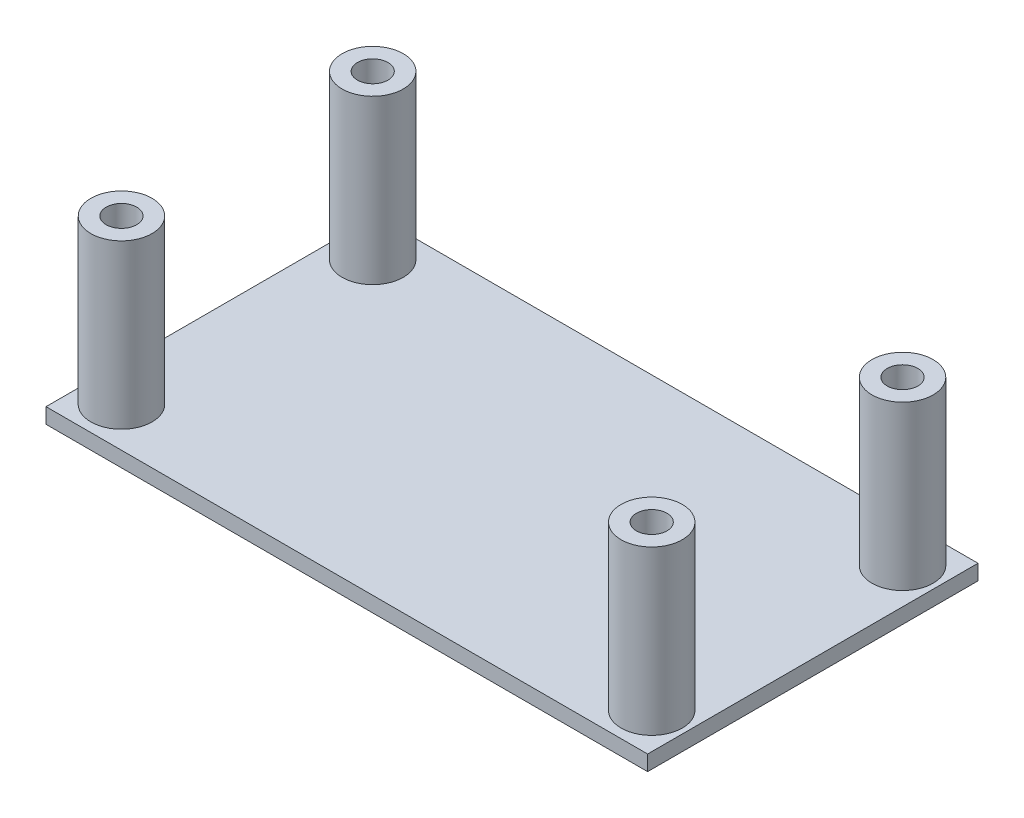
ISO-10303-21;
HEADER;
FILE_DESCRIPTION(('STEP AP214'),'2;1');
FILE_NAME('part.step','',(''),(''),'','','');
FILE_SCHEMA(('AUTOMOTIVE_DESIGN { 1 0 10303 214 1 1 1 1 }'));
ENDSEC;
DATA;
#1=APPLICATION_CONTEXT('core data for automotive mechanical design processes');
#2=APPLICATION_PROTOCOL_DEFINITION('international standard','automotive_design',2000,#1);
#3=PRODUCT_CONTEXT('',#1,'mechanical');
#4=PRODUCT('Part','Part','',(#3));
#5=PRODUCT_RELATED_PRODUCT_CATEGORY('part','',(#4));
#6=PRODUCT_DEFINITION_FORMATION('','',#4);
#7=PRODUCT_DEFINITION_CONTEXT('part definition',#1,'design');
#8=PRODUCT_DEFINITION('design','',#6,#7);
#9=PRODUCT_DEFINITION_SHAPE('','',#8);
#10=(LENGTH_UNIT() NAMED_UNIT(*) SI_UNIT(.MILLI.,.METRE.));
#11=(NAMED_UNIT(*) PLANE_ANGLE_UNIT() SI_UNIT($,.RADIAN.));
#12=(NAMED_UNIT(*) SI_UNIT($,.STERADIAN.) SOLID_ANGLE_UNIT());
#13=UNCERTAINTY_MEASURE_WITH_UNIT(LENGTH_MEASURE(1.E-05),#10,'distance_accuracy_value','');
#14=(GEOMETRIC_REPRESENTATION_CONTEXT(3) GLOBAL_UNCERTAINTY_ASSIGNED_CONTEXT((#13)) GLOBAL_UNIT_ASSIGNED_CONTEXT((#10,
#11,#12)) REPRESENTATION_CONTEXT('',''));
#15=CARTESIAN_POINT('',(0.,0.,0.));
#16=DIRECTION('',(0.,0.,1.));
#17=DIRECTION('',(1.,0.,0.));
#18=AXIS2_PLACEMENT_3D('',#15,#16,#17);
#19=CARTESIAN_POINT('',(0.,1.5,0.));
#20=DIRECTION('',(0.,1.,0.));
#21=DIRECTION('',(0.,0.,1.));
#22=AXIS2_PLACEMENT_3D('',#19,#20,#21);
#23=PLANE('',#22);
#24=DIRECTION('',(0.,0.,-1.));
#25=VECTOR('',#24,1.);
#26=CARTESIAN_POINT('',(33.3618988565565,1.5,-11.6656738072446));
#27=LINE('',#26,#25);
#28=CARTESIAN_POINT('',(33.3618988565565,1.5,20.7343261927554));
#29=VERTEX_POINT('',#28);
#30=CARTESIAN_POINT('',(33.3618988565565,1.5,-11.6656738072446));
#31=VERTEX_POINT('',#30);
#32=EDGE_CURVE('E79',#29,#31,#27,.T.);
#33=ORIENTED_EDGE('',*,*,#32,.T.);
#34=DIRECTION('',(1.,0.,0.));
#35=VECTOR('',#34,1.);
#36=CARTESIAN_POINT('',(-24.6381011434435,1.5,-11.6656738072446));
#37=LINE('',#36,#35);
#38=CARTESIAN_POINT('',(-25.6381011434435,1.5,-11.6656738072446));
#39=VERTEX_POINT('',#38);
#40=EDGE_CURVE('E109',#39,#31,#37,.T.);
#41=ORIENTED_EDGE('',*,*,#40,.F.);
#42=DIRECTION('',(0.,0.,1.));
#43=VECTOR('',#42,1.);
#44=CARTESIAN_POINT('',(-25.6381011434435,1.5,-11.6656738072446));
#45=LINE('',#44,#43);
#46=CARTESIAN_POINT('',(-25.6381011434435,1.5,20.7343261927554));
#47=VERTEX_POINT('',#46);
#48=EDGE_CURVE('E81',#39,#47,#45,.T.);
#49=ORIENTED_EDGE('',*,*,#48,.T.);
#50=DIRECTION('',(-1.,0.,0.));
#51=VECTOR('',#50,1.);
#52=CARTESIAN_POINT('',(-24.6381011434435,1.5,20.7343261927554));
#53=LINE('',#52,#51);
#54=EDGE_CURVE('E75',#29,#47,#53,.T.);
#55=ORIENTED_EDGE('',*,*,#54,.F.);
#56=EDGE_LOOP('',(#33,#41,#49,#55));
#57=FACE_BOUND('',#56,.T.);
#58=CARTESIAN_POINT('',(29.8618988565565,1.5,-7.76567380724461));
#59=DIRECTION('',(0.,1.,0.));
#60=DIRECTION('',(0.,0.,1.));
#61=AXIS2_PLACEMENT_3D('',#58,#59,#60);
#62=CIRCLE('',#61,3.);
#63=CARTESIAN_POINT('',(29.8618988565565,1.5,-4.76567380724461));
#64=VERTEX_POINT('',#63);
#65=EDGE_CURVE('E150',#64,#64,#62,.F.);
#66=ORIENTED_EDGE('',*,*,#65,.T.);
#67=EDGE_LOOP('',(#66));
#68=FACE_BOUND('',#67,.T.);
#69=CARTESIAN_POINT('',(29.8618988565565,1.5,16.8343261927554));
#70=DIRECTION('',(0.,1.,0.));
#71=DIRECTION('',(0.,0.,1.));
#72=AXIS2_PLACEMENT_3D('',#69,#70,#71);
#73=CIRCLE('',#72,3.);
#74=CARTESIAN_POINT('',(29.8618988565565,1.5,19.8343261927554));
#75=VERTEX_POINT('',#74);
#76=EDGE_CURVE('E11',#75,#75,#73,.F.);
#77=ORIENTED_EDGE('',*,*,#76,.T.);
#78=EDGE_LOOP('',(#77));
#79=FACE_BOUND('',#78,.T.);
#80=CARTESIAN_POINT('',(-22.1381011434435,1.5,16.8343261927554));
#81=DIRECTION('',(0.,1.,0.));
#82=DIRECTION('',(0.,0.,1.));
#83=AXIS2_PLACEMENT_3D('',#80,#81,#82);
#84=CIRCLE('',#83,3.);
#85=CARTESIAN_POINT('',(-22.1381011434435,1.5,19.8343261927554));
#86=VERTEX_POINT('',#85);
#87=EDGE_CURVE('E144',#86,#86,#84,.F.);
#88=ORIENTED_EDGE('',*,*,#87,.T.);
#89=EDGE_LOOP('',(#88));
#90=FACE_BOUND('',#89,.T.);
#91=CARTESIAN_POINT('',(-22.0993702767908,1.5,-7.76567380724461));
#92=DIRECTION('',(0.,1.,0.));
#93=DIRECTION('',(0.,0.,1.));
#94=AXIS2_PLACEMENT_3D('',#91,#92,#93);
#95=CIRCLE('',#94,3.);
#96=CARTESIAN_POINT('',(-22.0993702767908,1.5,-4.76567380724461));
#97=VERTEX_POINT('',#96);
#98=EDGE_CURVE('E138',#97,#97,#95,.T.);
#99=ORIENTED_EDGE('',*,*,#98,.F.);
#100=EDGE_LOOP('',(#99));
#101=FACE_BOUND('',#100,.T.);
#102=ADVANCED_FACE('F33',(#57,#68,#79,#90,#101),#23,.T.);
#103=CARTESIAN_POINT('',(0.,0.,0.));
#104=DIRECTION('',(0.,1.,0.));
#105=DIRECTION('',(0.,0.,1.));
#106=AXIS2_PLACEMENT_3D('',#103,#104,#105);
#107=PLANE('',#106);
#108=DIRECTION('',(-1.,0.,0.));
#109=VECTOR('',#108,1.);
#110=CARTESIAN_POINT('',(-24.6381011434435,0.,20.7343261927554));
#111=LINE('',#110,#109);
#112=CARTESIAN_POINT('',(33.3618988565565,0.,20.7343261927554));
#113=VERTEX_POINT('',#112);
#114=CARTESIAN_POINT('',(-25.6381011434435,0.,20.7343261927554));
#115=VERTEX_POINT('',#114);
#116=EDGE_CURVE('E55',#113,#115,#111,.T.);
#117=ORIENTED_EDGE('',*,*,#116,.T.);
#118=DIRECTION('',(0.,0.,-1.));
#119=VECTOR('',#118,1.);
#120=CARTESIAN_POINT('',(-25.6381011434435,0.,-11.6656738072446));
#121=LINE('',#120,#119);
#122=CARTESIAN_POINT('',(-25.6381011434435,0.,-11.6656738072446));
#123=VERTEX_POINT('',#122);
#124=EDGE_CURVE('E85',#115,#123,#121,.T.);
#125=ORIENTED_EDGE('',*,*,#124,.T.);
#126=DIRECTION('',(1.,0.,0.));
#127=VECTOR('',#126,1.);
#128=CARTESIAN_POINT('',(-24.6381011434435,0.,-11.6656738072446));
#129=LINE('',#128,#127);
#130=CARTESIAN_POINT('',(33.3618988565565,0.,-11.6656738072446));
#131=VERTEX_POINT('',#130);
#132=EDGE_CURVE('E48',#123,#131,#129,.T.);
#133=ORIENTED_EDGE('',*,*,#132,.T.);
#134=DIRECTION('',(0.,0.,1.));
#135=VECTOR('',#134,1.);
#136=CARTESIAN_POINT('',(33.3618988565565,0.,-11.6656738072446));
#137=LINE('',#136,#135);
#138=EDGE_CURVE('E99',#131,#113,#137,.T.);
#139=ORIENTED_EDGE('',*,*,#138,.T.);
#140=EDGE_LOOP('',(#117,#125,#133,#139));
#141=FACE_BOUND('',#140,.T.);
#142=ADVANCED_FACE('F35',(#141),#107,.F.);
#143=CARTESIAN_POINT('',(-22.0993702767908,17.5,-7.76567380724461));
#144=DIRECTION('',(0.,1.,0.));
#145=DIRECTION('',(0.,0.,1.));
#146=AXIS2_PLACEMENT_3D('',#143,#144,#145);
#147=PLANE('',#146);
#148=CARTESIAN_POINT('',(-22.0993702767908,17.5,-7.76567380724461));
#149=DIRECTION('',(0.,1.,0.));
#150=DIRECTION('',(0.,0.,1.));
#151=AXIS2_PLACEMENT_3D('',#148,#149,#150);
#152=CIRCLE('',#151,3.);
#153=CARTESIAN_POINT('',(-22.0993702767908,17.5,-4.76567380724461));
#154=VERTEX_POINT('',#153);
#155=EDGE_CURVE('E133',#154,#154,#152,.T.);
#156=ORIENTED_EDGE('',*,*,#155,.T.);
#157=EDGE_LOOP('',(#156));
#158=FACE_BOUND('',#157,.T.);
#159=CARTESIAN_POINT('',(-22.0993702767908,17.5,-7.76567380724461));
#160=DIRECTION('',(0.,1.,0.));
#161=DIRECTION('',(0.,0.,1.));
#162=AXIS2_PLACEMENT_3D('',#159,#160,#161);
#163=CIRCLE('',#162,1.5);
#164=CARTESIAN_POINT('',(-22.0993702767908,17.5,-6.26567380724461));
#165=VERTEX_POINT('',#164);
#166=EDGE_CURVE('E130',#165,#165,#163,.T.);
#167=ORIENTED_EDGE('',*,*,#166,.F.);
#168=EDGE_LOOP('',(#167));
#169=FACE_BOUND('',#168,.T.);
#170=ADVANCED_FACE('F182',(#158,#169),#147,.T.);
#171=CARTESIAN_POINT('',(-22.0993702767908,17.5,-7.76567380724461));
#172=DIRECTION('',(0.,-1.,0.));
#173=DIRECTION('',(0.,0.,-1.));
#174=AXIS2_PLACEMENT_3D('',#171,#172,#173);
#175=CYLINDRICAL_SURFACE('',#174,3.);
#176=ORIENTED_EDGE('',*,*,#155,.F.);
#177=EDGE_LOOP('',(#176));
#178=FACE_BOUND('',#177,.T.);
#179=ORIENTED_EDGE('',*,*,#98,.T.);
#180=EDGE_LOOP('',(#179));
#181=FACE_BOUND('',#180,.T.);
#182=ADVANCED_FACE('F196',(#178,#181),#175,.T.);
#183=CARTESIAN_POINT('',(-22.0993702767908,17.5,-7.76567380724461));
#184=DIRECTION('',(0.,-1.,0.));
#185=DIRECTION('',(0.,0.,-1.));
#186=AXIS2_PLACEMENT_3D('',#183,#184,#185);
#187=CYLINDRICAL_SURFACE('',#186,1.5);
#188=ORIENTED_EDGE('',*,*,#166,.T.);
#189=EDGE_LOOP('',(#188));
#190=FACE_BOUND('',#189,.T.);
#191=CARTESIAN_POINT('',(-22.0993702767908,1.5,-7.76567380724461));
#192=DIRECTION('',(0.,1.,0.));
#193=DIRECTION('',(0.,0.,1.));
#194=AXIS2_PLACEMENT_3D('',#191,#192,#193);
#195=CIRCLE('',#194,1.5);
#196=CARTESIAN_POINT('',(-22.0993702767908,1.5,-6.26567380724461));
#197=VERTEX_POINT('',#196);
#198=EDGE_CURVE('E129',#197,#197,#195,.T.);
#199=ORIENTED_EDGE('',*,*,#198,.F.);
#200=EDGE_LOOP('',(#199));
#201=FACE_BOUND('',#200,.T.);
#202=ADVANCED_FACE('F185',(#190,#201),#187,.F.);
#203=ORIENTED_EDGE('',*,*,#198,.T.);
#204=EDGE_LOOP('',(#203));
#205=FACE_BOUND('',#204,.T.);
#206=ADVANCED_FACE('F178',(#205),#23,.T.);
#207=CARTESIAN_POINT('',(-22.1381011434435,17.5,16.8343261927554));
#208=DIRECTION('',(0.,1.,0.));
#209=DIRECTION('',(0.,0.,1.));
#210=AXIS2_PLACEMENT_3D('',#207,#208,#209);
#211=PLANE('',#210);
#212=CARTESIAN_POINT('',(-22.1381011434435,17.5,16.8343261927554));
#213=DIRECTION('',(0.,1.,0.));
#214=DIRECTION('',(0.,0.,1.));
#215=AXIS2_PLACEMENT_3D('',#212,#213,#214);
#216=CIRCLE('',#215,3.);
#217=CARTESIAN_POINT('',(-22.1381011434435,17.5,19.8343261927554));
#218=VERTEX_POINT('',#217);
#219=EDGE_CURVE('E126',#218,#218,#216,.T.);
#220=ORIENTED_EDGE('',*,*,#219,.T.);
#221=EDGE_LOOP('',(#220));
#222=FACE_BOUND('',#221,.T.);
#223=CARTESIAN_POINT('',(-22.1381011434435,17.5,16.8343261927554));
#224=DIRECTION('',(0.,1.,0.));
#225=DIRECTION('',(0.,0.,1.));
#226=AXIS2_PLACEMENT_3D('',#223,#224,#225);
#227=CIRCLE('',#226,1.5);
#228=CARTESIAN_POINT('',(-22.1381011434435,17.5,18.3343261927554));
#229=VERTEX_POINT('',#228);
#230=EDGE_CURVE('E123',#229,#229,#227,.T.);
#231=ORIENTED_EDGE('',*,*,#230,.F.);
#232=EDGE_LOOP('',(#231));
#233=FACE_BOUND('',#232,.T.);
#234=ADVANCED_FACE('F184',(#222,#233),#211,.T.);
#235=CARTESIAN_POINT('',(-22.1381011434435,17.5,16.8343261927554));
#236=DIRECTION('',(0.,-1.,0.));
#237=DIRECTION('',(0.,0.,-1.));
#238=AXIS2_PLACEMENT_3D('',#235,#236,#237);
#239=CYLINDRICAL_SURFACE('',#238,3.);
#240=ORIENTED_EDGE('',*,*,#219,.F.);
#241=EDGE_LOOP('',(#240));
#242=FACE_BOUND('',#241,.T.);
#243=ORIENTED_EDGE('',*,*,#87,.F.);
#244=EDGE_LOOP('',(#243));
#245=FACE_BOUND('',#244,.T.);
#246=ADVANCED_FACE('F192',(#242,#245),#239,.T.);
#247=CARTESIAN_POINT('',(-22.1381011434435,17.5,16.8343261927554));
#248=DIRECTION('',(0.,-1.,0.));
#249=DIRECTION('',(0.,0.,-1.));
#250=AXIS2_PLACEMENT_3D('',#247,#248,#249);
#251=CYLINDRICAL_SURFACE('',#250,1.5);
#252=ORIENTED_EDGE('',*,*,#230,.T.);
#253=EDGE_LOOP('',(#252));
#254=FACE_BOUND('',#253,.T.);
#255=CARTESIAN_POINT('',(-22.1381011434435,1.5,16.8343261927554));
#256=DIRECTION('',(0.,1.,0.));
#257=DIRECTION('',(0.,0.,1.));
#258=AXIS2_PLACEMENT_3D('',#255,#256,#257);
#259=CIRCLE('',#258,1.5);
#260=CARTESIAN_POINT('',(-22.1381011434435,1.5,18.3343261927554));
#261=VERTEX_POINT('',#260);
#262=EDGE_CURVE('E141',#261,#261,#259,.F.);
#263=ORIENTED_EDGE('',*,*,#262,.T.);
#264=EDGE_LOOP('',(#263));
#265=FACE_BOUND('',#264,.T.);
#266=ADVANCED_FACE('F201',(#254,#265),#251,.F.);
#267=ORIENTED_EDGE('',*,*,#262,.F.);
#268=EDGE_LOOP('',(#267));
#269=FACE_BOUND('',#268,.T.);
#270=ADVANCED_FACE('F176',(#269),#23,.T.);
#271=CARTESIAN_POINT('',(29.8618988565565,17.5,-7.76567380724461));
#272=DIRECTION('',(0.,1.,0.));
#273=DIRECTION('',(0.,0.,1.));
#274=AXIS2_PLACEMENT_3D('',#271,#272,#273);
#275=PLANE('',#274);
#276=CARTESIAN_POINT('',(29.8618988565565,17.5,-7.76567380724461));
#277=DIRECTION('',(0.,1.,0.));
#278=DIRECTION('',(0.,0.,1.));
#279=AXIS2_PLACEMENT_3D('',#276,#277,#278);
#280=CIRCLE('',#279,3.);
#281=CARTESIAN_POINT('',(29.8618988565565,17.5,-4.76567380724461));
#282=VERTEX_POINT('',#281);
#283=EDGE_CURVE('E120',#282,#282,#280,.T.);
#284=ORIENTED_EDGE('',*,*,#283,.T.);
#285=EDGE_LOOP('',(#284));
#286=FACE_BOUND('',#285,.T.);
#287=CARTESIAN_POINT('',(29.8618988565565,17.5,-7.76567380724461));
#288=DIRECTION('',(0.,1.,0.));
#289=DIRECTION('',(0.,0.,1.));
#290=AXIS2_PLACEMENT_3D('',#287,#288,#289);
#291=CIRCLE('',#290,1.5);
#292=CARTESIAN_POINT('',(29.8618988565565,17.5,-6.26567380724461));
#293=VERTEX_POINT('',#292);
#294=EDGE_CURVE('E117',#293,#293,#291,.T.);
#295=ORIENTED_EDGE('',*,*,#294,.F.);
#296=EDGE_LOOP('',(#295));
#297=FACE_BOUND('',#296,.T.);
#298=ADVANCED_FACE('F200',(#286,#297),#275,.T.);
#299=CARTESIAN_POINT('',(29.8618988565565,17.5,-7.76567380724461));
#300=DIRECTION('',(0.,-1.,0.));
#301=DIRECTION('',(0.,0.,-1.));
#302=AXIS2_PLACEMENT_3D('',#299,#300,#301);
#303=CYLINDRICAL_SURFACE('',#302,3.);
#304=ORIENTED_EDGE('',*,*,#283,.F.);
#305=EDGE_LOOP('',(#304));
#306=FACE_BOUND('',#305,.T.);
#307=ORIENTED_EDGE('',*,*,#65,.F.);
#308=EDGE_LOOP('',(#307));
#309=FACE_BOUND('',#308,.T.);
#310=ADVANCED_FACE('F208',(#306,#309),#303,.T.);
#311=CARTESIAN_POINT('',(29.8618988565565,17.5,-7.76567380724461));
#312=DIRECTION('',(0.,-1.,0.));
#313=DIRECTION('',(0.,0.,-1.));
#314=AXIS2_PLACEMENT_3D('',#311,#312,#313);
#315=CYLINDRICAL_SURFACE('',#314,1.5);
#316=ORIENTED_EDGE('',*,*,#294,.T.);
#317=EDGE_LOOP('',(#316));
#318=FACE_BOUND('',#317,.T.);
#319=CARTESIAN_POINT('',(29.8618988565565,1.5,-7.76567380724461));
#320=DIRECTION('',(0.,1.,0.));
#321=DIRECTION('',(0.,0.,1.));
#322=AXIS2_PLACEMENT_3D('',#319,#320,#321);
#323=CIRCLE('',#322,1.5);
#324=CARTESIAN_POINT('',(29.8618988565565,1.5,-6.26567380724461));
#325=VERTEX_POINT('',#324);
#326=EDGE_CURVE('E147',#325,#325,#323,.F.);
#327=ORIENTED_EDGE('',*,*,#326,.T.);
#328=EDGE_LOOP('',(#327));
#329=FACE_BOUND('',#328,.T.);
#330=ADVANCED_FACE('F174',(#318,#329),#315,.F.);
#331=ORIENTED_EDGE('',*,*,#326,.F.);
#332=EDGE_LOOP('',(#331));
#333=FACE_BOUND('',#332,.T.);
#334=ADVANCED_FACE('F159',(#333),#23,.T.);
#335=CARTESIAN_POINT('',(29.8618988565565,17.5,16.8343261927554));
#336=DIRECTION('',(0.,1.,0.));
#337=DIRECTION('',(0.,0.,1.));
#338=AXIS2_PLACEMENT_3D('',#335,#336,#337);
#339=PLANE('',#338);
#340=CARTESIAN_POINT('',(29.8618988565565,17.5,16.8343261927554));
#341=DIRECTION('',(0.,1.,0.));
#342=DIRECTION('',(0.,0.,1.));
#343=AXIS2_PLACEMENT_3D('',#340,#341,#342);
#344=CIRCLE('',#343,3.);
#345=CARTESIAN_POINT('',(29.8618988565565,17.5,19.8343261927554));
#346=VERTEX_POINT('',#345);
#347=EDGE_CURVE('E114',#346,#346,#344,.T.);
#348=ORIENTED_EDGE('',*,*,#347,.T.);
#349=EDGE_LOOP('',(#348));
#350=FACE_BOUND('',#349,.T.);
#351=CARTESIAN_POINT('',(29.8618988565565,17.5,16.8343261927554));
#352=DIRECTION('',(0.,1.,0.));
#353=DIRECTION('',(0.,0.,1.));
#354=AXIS2_PLACEMENT_3D('',#351,#352,#353);
#355=CIRCLE('',#354,1.5);
#356=CARTESIAN_POINT('',(29.8618988565565,17.5,18.3343261927554));
#357=VERTEX_POINT('',#356);
#358=EDGE_CURVE('E108',#357,#357,#355,.T.);
#359=ORIENTED_EDGE('',*,*,#358,.F.);
#360=EDGE_LOOP('',(#359));
#361=FACE_BOUND('',#360,.T.);
#362=ADVANCED_FACE('F173',(#350,#361),#339,.T.);
#363=CARTESIAN_POINT('',(29.8618988565565,17.5,16.8343261927554));
#364=DIRECTION('',(0.,-1.,0.));
#365=DIRECTION('',(0.,0.,-1.));
#366=AXIS2_PLACEMENT_3D('',#363,#364,#365);
#367=CYLINDRICAL_SURFACE('',#366,3.);
#368=ORIENTED_EDGE('',*,*,#347,.F.);
#369=EDGE_LOOP('',(#368));
#370=FACE_BOUND('',#369,.T.);
#371=ORIENTED_EDGE('',*,*,#76,.F.);
#372=EDGE_LOOP('',(#371));
#373=FACE_BOUND('',#372,.T.);
#374=ADVANCED_FACE('F168',(#370,#373),#367,.T.);
#375=CARTESIAN_POINT('',(29.8618988565565,17.5,16.8343261927554));
#376=DIRECTION('',(0.,-1.,0.));
#377=DIRECTION('',(0.,0.,-1.));
#378=AXIS2_PLACEMENT_3D('',#375,#376,#377);
#379=CYLINDRICAL_SURFACE('',#378,1.5);
#380=ORIENTED_EDGE('',*,*,#358,.T.);
#381=EDGE_LOOP('',(#380));
#382=FACE_BOUND('',#381,.T.);
#383=CARTESIAN_POINT('',(29.8618988565565,1.5,16.8343261927554));
#384=DIRECTION('',(0.,1.,0.));
#385=DIRECTION('',(0.,0.,1.));
#386=AXIS2_PLACEMENT_3D('',#383,#384,#385);
#387=CIRCLE('',#386,1.5);
#388=CARTESIAN_POINT('',(29.8618988565565,1.5,18.3343261927554));
#389=VERTEX_POINT('',#388);
#390=EDGE_CURVE('E41',#389,#389,#387,.F.);
#391=ORIENTED_EDGE('',*,*,#390,.T.);
#392=EDGE_LOOP('',(#391));
#393=FACE_BOUND('',#392,.T.);
#394=ADVANCED_FACE('F155',(#382,#393),#379,.F.);
#395=ORIENTED_EDGE('',*,*,#390,.F.);
#396=EDGE_LOOP('',(#395));
#397=FACE_BOUND('',#396,.T.);
#398=ADVANCED_FACE('F157',(#397),#23,.T.);
#399=CARTESIAN_POINT('',(-24.6381011434435,0.,20.7343261927554));
#400=DIRECTION('',(0.,0.,-1.));
#401=DIRECTION('',(-1.,0.,0.));
#402=AXIS2_PLACEMENT_3D('',#399,#400,#401);
#403=PLANE('',#402);
#404=ORIENTED_EDGE('',*,*,#54,.T.);
#405=DIRECTION('',(0.,1.,0.));
#406=VECTOR('',#405,1.);
#407=CARTESIAN_POINT('',(-25.6381011434435,-32.4154284253656,20.7343261927554));
#408=LINE('',#407,#406);
#409=EDGE_CURVE('E104',#115,#47,#408,.T.);
#410=ORIENTED_EDGE('',*,*,#409,.F.);
#411=ORIENTED_EDGE('',*,*,#116,.F.);
#412=DIRECTION('',(0.,1.,0.));
#413=VECTOR('',#412,1.);
#414=CARTESIAN_POINT('',(33.3618988565565,-32.4154284253656,20.7343261927554));
#415=LINE('',#414,#413);
#416=EDGE_CURVE('E88',#113,#29,#415,.T.);
#417=ORIENTED_EDGE('',*,*,#416,.T.);
#418=EDGE_LOOP('',(#404,#410,#411,#417));
#419=FACE_BOUND('',#418,.T.);
#420=ADVANCED_FACE('F89',(#419),#403,.F.);
#421=CARTESIAN_POINT('',(-24.6381011434435,0.,-11.6656738072446));
#422=DIRECTION('',(0.,0.,1.));
#423=DIRECTION('',(1.,0.,0.));
#424=AXIS2_PLACEMENT_3D('',#421,#422,#423);
#425=PLANE('',#424);
#426=ORIENTED_EDGE('',*,*,#40,.T.);
#427=DIRECTION('',(0.,1.,0.));
#428=VECTOR('',#427,1.);
#429=CARTESIAN_POINT('',(33.3618988565565,-32.4154284253656,-11.6656738072446));
#430=LINE('',#429,#428);
#431=EDGE_CURVE('E92',#131,#31,#430,.T.);
#432=ORIENTED_EDGE('',*,*,#431,.F.);
#433=ORIENTED_EDGE('',*,*,#132,.F.);
#434=DIRECTION('',(0.,1.,0.));
#435=VECTOR('',#434,1.);
#436=CARTESIAN_POINT('',(-25.6381011434435,-32.4154284253656,-11.6656738072446));
#437=LINE('',#436,#435);
#438=EDGE_CURVE('E102',#123,#39,#437,.T.);
#439=ORIENTED_EDGE('',*,*,#438,.T.);
#440=EDGE_LOOP('',(#426,#432,#433,#439));
#441=FACE_BOUND('',#440,.T.);
#442=ADVANCED_FACE('F165',(#441),#425,.F.);
#443=CARTESIAN_POINT('',(-25.6381011434435,-32.4154284253656,-11.6656738072446));
#444=DIRECTION('',(-1.,0.,0.));
#445=DIRECTION('',(0.,0.,1.));
#446=AXIS2_PLACEMENT_3D('',#443,#444,#445);
#447=PLANE('',#446);
#448=ORIENTED_EDGE('',*,*,#124,.F.);
#449=ORIENTED_EDGE('',*,*,#409,.T.);
#450=ORIENTED_EDGE('',*,*,#48,.F.);
#451=ORIENTED_EDGE('',*,*,#438,.F.);
#452=EDGE_LOOP('',(#448,#449,#450,#451));
#453=FACE_BOUND('',#452,.T.);
#454=ADVANCED_FACE('F290',(#453),#447,.T.);
#455=CARTESIAN_POINT('',(33.3618988565565,-32.4154284253656,-11.6656738072446));
#456=DIRECTION('',(1.,0.,0.));
#457=DIRECTION('',(0.,0.,-1.));
#458=AXIS2_PLACEMENT_3D('',#455,#456,#457);
#459=PLANE('',#458);
#460=ORIENTED_EDGE('',*,*,#138,.F.);
#461=ORIENTED_EDGE('',*,*,#431,.T.);
#462=ORIENTED_EDGE('',*,*,#32,.F.);
#463=ORIENTED_EDGE('',*,*,#416,.F.);
#464=EDGE_LOOP('',(#460,#461,#462,#463));
#465=FACE_BOUND('',#464,.T.);
#466=ADVANCED_FACE('F95',(#465),#459,.T.);
#467=CLOSED_SHELL('',(#102,#142,#170,#182,#202,#206,#234,#246,#266,#270,#298,#310,#330,#334,
#362,#374,#394,#398,#420,#442,#454,#466));
#468=MANIFOLD_SOLID_BREP('B2',#467);
#469=ADVANCED_BREP_SHAPE_REPRESENTATION('',(#18,#468),#14);
#470=SHAPE_DEFINITION_REPRESENTATION(#9,#469);
ENDSEC;
END-ISO-10303-21;
